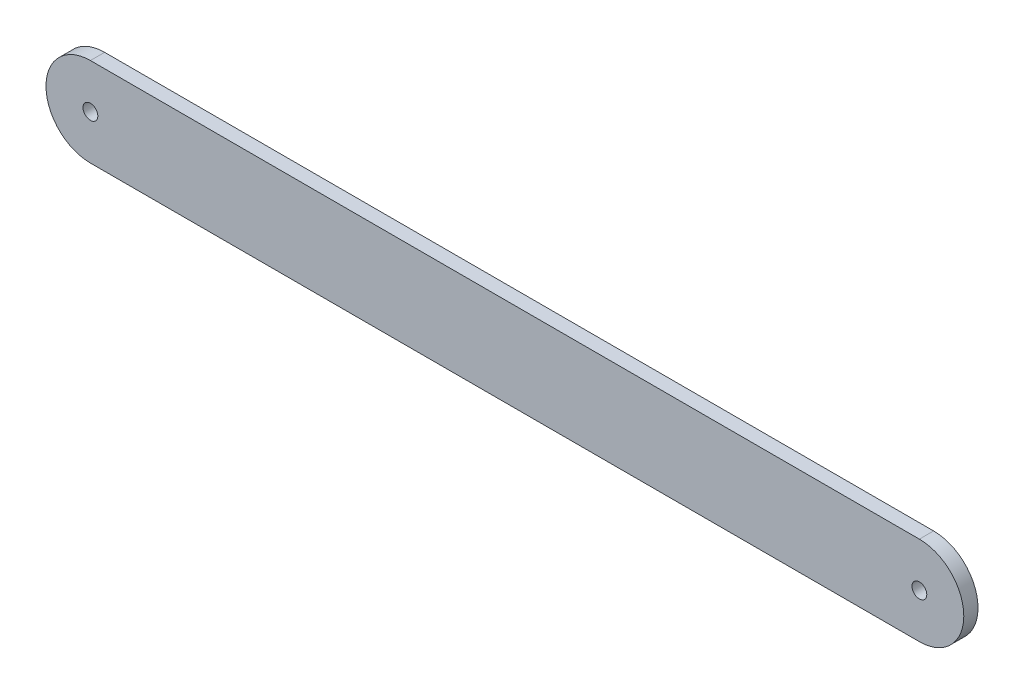
ISO-10303-21;
HEADER;
FILE_DESCRIPTION(('STEP AP214'),'2;1');
FILE_NAME('part.step','',(''),(''),'','','');
FILE_SCHEMA(('AUTOMOTIVE_DESIGN { 1 0 10303 214 1 1 1 1 }'));
ENDSEC;
DATA;
#1=APPLICATION_CONTEXT('core data for automotive mechanical design processes');
#2=APPLICATION_PROTOCOL_DEFINITION('international standard','automotive_design',2000,#1);
#3=PRODUCT_CONTEXT('',#1,'mechanical');
#4=PRODUCT('Part','Part','',(#3));
#5=PRODUCT_RELATED_PRODUCT_CATEGORY('part','',(#4));
#6=PRODUCT_DEFINITION_FORMATION('','',#4);
#7=PRODUCT_DEFINITION_CONTEXT('part definition',#1,'design');
#8=PRODUCT_DEFINITION('design','',#6,#7);
#9=PRODUCT_DEFINITION_SHAPE('','',#8);
#10=(LENGTH_UNIT() NAMED_UNIT(*) SI_UNIT(.MILLI.,.METRE.));
#11=(NAMED_UNIT(*) PLANE_ANGLE_UNIT() SI_UNIT($,.RADIAN.));
#12=(NAMED_UNIT(*) SI_UNIT($,.STERADIAN.) SOLID_ANGLE_UNIT());
#13=UNCERTAINTY_MEASURE_WITH_UNIT(LENGTH_MEASURE(1.E-05),#10,'distance_accuracy_value','');
#14=(GEOMETRIC_REPRESENTATION_CONTEXT(3) GLOBAL_UNCERTAINTY_ASSIGNED_CONTEXT((#13)) GLOBAL_UNIT_ASSIGNED_CONTEXT((#10,
#11,#12)) REPRESENTATION_CONTEXT('',''));
#15=CARTESIAN_POINT('',(0.,0.,0.));
#16=DIRECTION('',(0.,0.,1.));
#17=DIRECTION('',(1.,0.,0.));
#18=AXIS2_PLACEMENT_3D('',#15,#16,#17);
#19=CARTESIAN_POINT('',(0.,0.,3.048));
#20=DIRECTION('',(0.,0.,1.));
#21=DIRECTION('',(1.,0.,0.));
#22=AXIS2_PLACEMENT_3D('',#19,#20,#21);
#23=PLANE('',#22);
#24=CARTESIAN_POINT('',(0.,0.,3.048));
#25=DIRECTION('',(0.,0.,1.));
#26=DIRECTION('',(1.,0.,0.));
#27=AXIS2_PLACEMENT_3D('',#24,#25,#26);
#28=CIRCLE('',#27,1.5875);
#29=CARTESIAN_POINT('',(1.5875,0.,3.048));
#30=VERTEX_POINT('',#29);
#31=EDGE_CURVE('E102',#30,#30,#28,.T.);
#32=ORIENTED_EDGE('',*,*,#31,.F.);
#33=EDGE_LOOP('',(#32));
#34=FACE_BOUND('',#33,.T.);
#35=CARTESIAN_POINT('',(0.,0.,3.048));
#36=DIRECTION('',(0.,0.,1.));
#37=DIRECTION('',(1.,0.,0.));
#38=AXIS2_PLACEMENT_3D('',#35,#36,#37);
#39=CIRCLE('',#38,9.525);
#40=CARTESIAN_POINT('',(0.,9.525,3.048));
#41=VERTEX_POINT('',#40);
#42=CARTESIAN_POINT('',(0.,-9.525,3.048));
#43=VERTEX_POINT('',#42);
#44=EDGE_CURVE('E87',#41,#43,#39,.T.);
#45=ORIENTED_EDGE('',*,*,#44,.T.);
#46=DIRECTION('',(1.,0.,0.));
#47=VECTOR('',#46,1.);
#48=CARTESIAN_POINT('',(0.,-9.525,3.048));
#49=LINE('',#48,#47);
#50=CARTESIAN_POINT('',(177.8,-9.525,3.048));
#51=VERTEX_POINT('',#50);
#52=EDGE_CURVE('E82',#43,#51,#49,.T.);
#53=ORIENTED_EDGE('',*,*,#52,.T.);
#54=CARTESIAN_POINT('',(177.8,0.,3.048));
#55=DIRECTION('',(0.,0.,1.));
#56=DIRECTION('',(1.,0.,0.));
#57=AXIS2_PLACEMENT_3D('',#54,#55,#56);
#58=CIRCLE('',#57,9.525);
#59=CARTESIAN_POINT('',(177.8,9.525,3.048));
#60=VERTEX_POINT('',#59);
#61=EDGE_CURVE('E85',#51,#60,#58,.T.);
#62=ORIENTED_EDGE('',*,*,#61,.T.);
#63=DIRECTION('',(-1.,0.,0.));
#64=VECTOR('',#63,1.);
#65=CARTESIAN_POINT('',(0.,9.525,3.048));
#66=LINE('',#65,#64);
#67=EDGE_CURVE('E52',#60,#41,#66,.T.);
#68=ORIENTED_EDGE('',*,*,#67,.T.);
#69=EDGE_LOOP('',(#45,#53,#62,#68));
#70=FACE_BOUND('',#69,.T.);
#71=CARTESIAN_POINT('',(177.8,0.,3.048));
#72=DIRECTION('',(0.,0.,1.));
#73=DIRECTION('',(1.,0.,0.));
#74=AXIS2_PLACEMENT_3D('',#71,#72,#73);
#75=CIRCLE('',#74,1.58749999999999);
#76=CARTESIAN_POINT('',(179.3875,0.,3.048));
#77=VERTEX_POINT('',#76);
#78=EDGE_CURVE('E117',#77,#77,#75,.T.);
#79=ORIENTED_EDGE('',*,*,#78,.F.);
#80=EDGE_LOOP('',(#79));
#81=FACE_BOUND('',#80,.T.);
#82=ADVANCED_FACE('F35',(#34,#70,#81),#23,.T.);
#83=CARTESIAN_POINT('',(0.,0.,0.));
#84=DIRECTION('',(0.,0.,1.));
#85=DIRECTION('',(1.,0.,0.));
#86=AXIS2_PLACEMENT_3D('',#83,#84,#85);
#87=PLANE('',#86);
#88=CARTESIAN_POINT('',(0.,0.,0.));
#89=DIRECTION('',(0.,0.,1.));
#90=DIRECTION('',(1.,0.,0.));
#91=AXIS2_PLACEMENT_3D('',#88,#89,#90);
#92=CIRCLE('',#91,9.525);
#93=CARTESIAN_POINT('',(0.,9.525,0.));
#94=VERTEX_POINT('',#93);
#95=CARTESIAN_POINT('',(0.,-9.525,0.));
#96=VERTEX_POINT('',#95);
#97=EDGE_CURVE('E99',#94,#96,#92,.T.);
#98=ORIENTED_EDGE('',*,*,#97,.F.);
#99=DIRECTION('',(-1.,0.,0.));
#100=VECTOR('',#99,1.);
#101=CARTESIAN_POINT('',(0.,9.525,0.));
#102=LINE('',#101,#100);
#103=CARTESIAN_POINT('',(177.8,9.525,0.));
#104=VERTEX_POINT('',#103);
#105=EDGE_CURVE('E75',#104,#94,#102,.T.);
#106=ORIENTED_EDGE('',*,*,#105,.F.);
#107=CARTESIAN_POINT('',(177.8,0.,0.));
#108=DIRECTION('',(0.,0.,1.));
#109=DIRECTION('',(1.,0.,0.));
#110=AXIS2_PLACEMENT_3D('',#107,#108,#109);
#111=CIRCLE('',#110,9.525);
#112=CARTESIAN_POINT('',(177.8,-9.525,0.));
#113=VERTEX_POINT('',#112);
#114=EDGE_CURVE('E69',#113,#104,#111,.T.);
#115=ORIENTED_EDGE('',*,*,#114,.F.);
#116=DIRECTION('',(1.,0.,0.));
#117=VECTOR('',#116,1.);
#118=CARTESIAN_POINT('',(0.,-9.525,0.));
#119=LINE('',#118,#117);
#120=EDGE_CURVE('E91',#96,#113,#119,.T.);
#121=ORIENTED_EDGE('',*,*,#120,.F.);
#122=EDGE_LOOP('',(#98,#106,#115,#121));
#123=FACE_BOUND('',#122,.T.);
#124=CARTESIAN_POINT('',(0.,0.,0.));
#125=DIRECTION('',(0.,0.,1.));
#126=DIRECTION('',(1.,0.,0.));
#127=AXIS2_PLACEMENT_3D('',#124,#125,#126);
#128=CIRCLE('',#127,1.5875);
#129=CARTESIAN_POINT('',(1.5875,0.,0.));
#130=VERTEX_POINT('',#129);
#131=EDGE_CURVE('E114',#130,#130,#128,.T.);
#132=ORIENTED_EDGE('',*,*,#131,.T.);
#133=EDGE_LOOP('',(#132));
#134=FACE_BOUND('',#133,.T.);
#135=CARTESIAN_POINT('',(177.8,0.,0.));
#136=DIRECTION('',(0.,0.,1.));
#137=DIRECTION('',(1.,0.,0.));
#138=AXIS2_PLACEMENT_3D('',#135,#136,#137);
#139=CIRCLE('',#138,1.58749999999999);
#140=CARTESIAN_POINT('',(179.3875,0.,0.));
#141=VERTEX_POINT('',#140);
#142=EDGE_CURVE('E120',#141,#141,#139,.T.);
#143=ORIENTED_EDGE('',*,*,#142,.T.);
#144=EDGE_LOOP('',(#143));
#145=FACE_BOUND('',#144,.T.);
#146=ADVANCED_FACE('F110',(#123,#134,#145),#87,.F.);
#147=CARTESIAN_POINT('',(0.,0.,3.048));
#148=DIRECTION('',(0.,0.,-1.));
#149=DIRECTION('',(-1.,0.,0.));
#150=AXIS2_PLACEMENT_3D('',#147,#148,#149);
#151=CYLINDRICAL_SURFACE('',#150,9.525);
#152=ORIENTED_EDGE('',*,*,#97,.T.);
#153=DIRECTION('',(0.,0.,-1.));
#154=VECTOR('',#153,1.);
#155=CARTESIAN_POINT('',(0.,-9.525,3.048));
#156=LINE('',#155,#154);
#157=EDGE_CURVE('E11',#43,#96,#156,.T.);
#158=ORIENTED_EDGE('',*,*,#157,.F.);
#159=ORIENTED_EDGE('',*,*,#44,.F.);
#160=DIRECTION('',(0.,0.,-1.));
#161=VECTOR('',#160,1.);
#162=CARTESIAN_POINT('',(0.,9.525,3.048));
#163=LINE('',#162,#161);
#164=EDGE_CURVE('E95',#41,#94,#163,.T.);
#165=ORIENTED_EDGE('',*,*,#164,.T.);
#166=EDGE_LOOP('',(#152,#158,#159,#165));
#167=FACE_BOUND('',#166,.T.);
#168=ADVANCED_FACE('F37',(#167),#151,.T.);
#169=CARTESIAN_POINT('',(0.,-9.525,3.048));
#170=DIRECTION('',(0.,1.,0.));
#171=DIRECTION('',(0.,0.,1.));
#172=AXIS2_PLACEMENT_3D('',#169,#170,#171);
#173=PLANE('',#172);
#174=ORIENTED_EDGE('',*,*,#120,.T.);
#175=DIRECTION('',(0.,0.,-1.));
#176=VECTOR('',#175,1.);
#177=CARTESIAN_POINT('',(177.8,-9.525,3.048));
#178=LINE('',#177,#176);
#179=EDGE_CURVE('E44',#51,#113,#178,.T.);
#180=ORIENTED_EDGE('',*,*,#179,.F.);
#181=ORIENTED_EDGE('',*,*,#52,.F.);
#182=ORIENTED_EDGE('',*,*,#157,.T.);
#183=EDGE_LOOP('',(#174,#180,#181,#182));
#184=FACE_BOUND('',#183,.T.);
#185=ADVANCED_FACE('F90',(#184),#173,.F.);
#186=CARTESIAN_POINT('',(177.8,0.,3.048));
#187=DIRECTION('',(0.,0.,-1.));
#188=DIRECTION('',(-1.,0.,0.));
#189=AXIS2_PLACEMENT_3D('',#186,#187,#188);
#190=CYLINDRICAL_SURFACE('',#189,9.525);
#191=ORIENTED_EDGE('',*,*,#114,.T.);
#192=DIRECTION('',(0.,0.,-1.));
#193=VECTOR('',#192,1.);
#194=CARTESIAN_POINT('',(177.8,9.525,3.048));
#195=LINE('',#194,#193);
#196=EDGE_CURVE('E92',#60,#104,#195,.T.);
#197=ORIENTED_EDGE('',*,*,#196,.F.);
#198=ORIENTED_EDGE('',*,*,#61,.F.);
#199=ORIENTED_EDGE('',*,*,#179,.T.);
#200=EDGE_LOOP('',(#191,#197,#198,#199));
#201=FACE_BOUND('',#200,.T.);
#202=ADVANCED_FACE('F93',(#201),#190,.T.);
#203=CARTESIAN_POINT('',(0.,9.525,3.048));
#204=DIRECTION('',(0.,-1.,0.));
#205=DIRECTION('',(0.,0.,-1.));
#206=AXIS2_PLACEMENT_3D('',#203,#204,#205);
#207=PLANE('',#206);
#208=ORIENTED_EDGE('',*,*,#105,.T.);
#209=ORIENTED_EDGE('',*,*,#164,.F.);
#210=ORIENTED_EDGE('',*,*,#67,.F.);
#211=ORIENTED_EDGE('',*,*,#196,.T.);
#212=EDGE_LOOP('',(#208,#209,#210,#211));
#213=FACE_BOUND('',#212,.T.);
#214=ADVANCED_FACE('F107',(#213),#207,.F.);
#215=CARTESIAN_POINT('',(0.,0.,3.048));
#216=DIRECTION('',(0.,0.,-1.));
#217=DIRECTION('',(-1.,0.,0.));
#218=AXIS2_PLACEMENT_3D('',#215,#216,#217);
#219=CYLINDRICAL_SURFACE('',#218,1.5875);
#220=ORIENTED_EDGE('',*,*,#31,.T.);
#221=EDGE_LOOP('',(#220));
#222=FACE_BOUND('',#221,.T.);
#223=ORIENTED_EDGE('',*,*,#131,.F.);
#224=EDGE_LOOP('',(#223));
#225=FACE_BOUND('',#224,.T.);
#226=ADVANCED_FACE('F137',(#222,#225),#219,.F.);
#227=CARTESIAN_POINT('',(177.8,0.,3.048));
#228=DIRECTION('',(0.,0.,-1.));
#229=DIRECTION('',(-1.,0.,0.));
#230=AXIS2_PLACEMENT_3D('',#227,#228,#229);
#231=CYLINDRICAL_SURFACE('',#230,1.58749999999999);
#232=ORIENTED_EDGE('',*,*,#78,.T.);
#233=EDGE_LOOP('',(#232));
#234=FACE_BOUND('',#233,.T.);
#235=ORIENTED_EDGE('',*,*,#142,.F.);
#236=EDGE_LOOP('',(#235));
#237=FACE_BOUND('',#236,.T.);
#238=ADVANCED_FACE('F126',(#234,#237),#231,.F.);
#239=CLOSED_SHELL('',(#82,#146,#168,#185,#202,#214,#226,#238));
#240=MANIFOLD_SOLID_BREP('B2',#239);
#241=ADVANCED_BREP_SHAPE_REPRESENTATION('',(#18,#240),#14);
#242=SHAPE_DEFINITION_REPRESENTATION(#9,#241);
ENDSEC;
END-ISO-10303-21;
